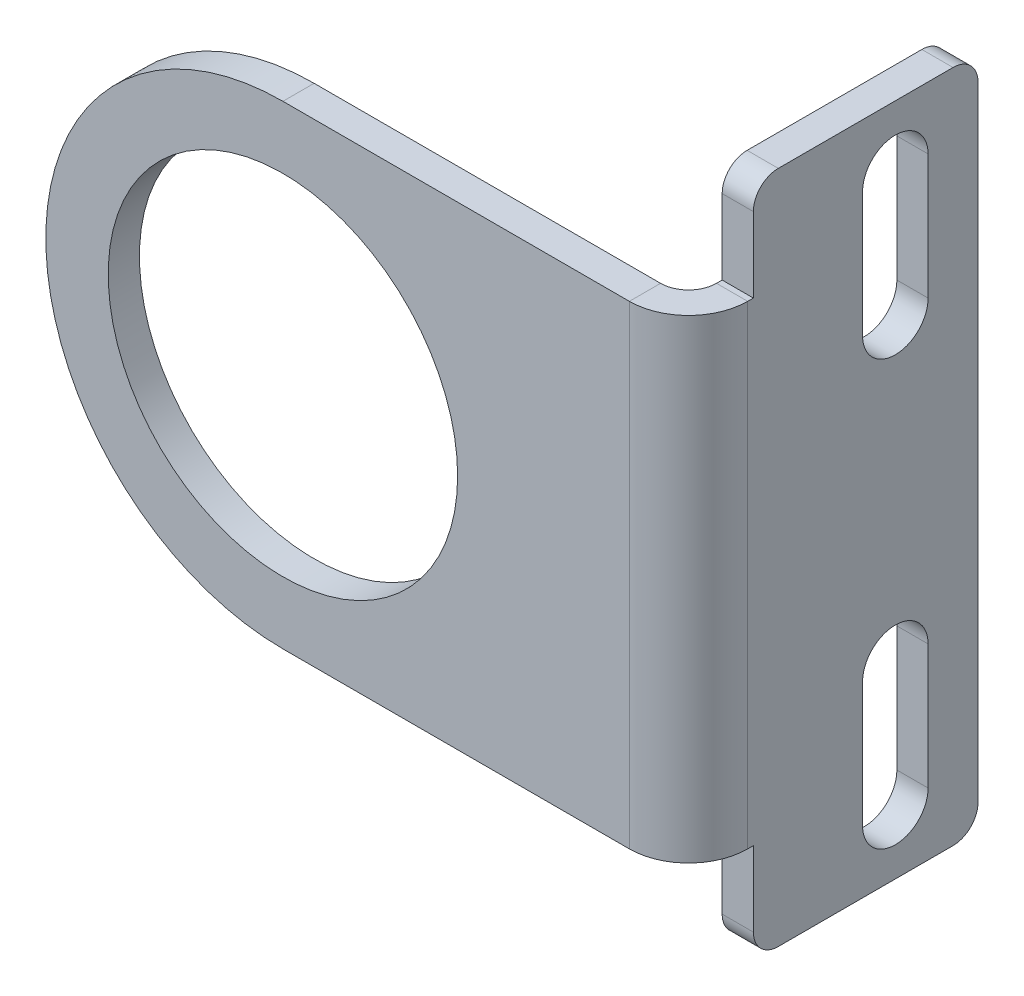
ISO-10303-21;
HEADER;
FILE_DESCRIPTION(('STEP AP214'),'2;1');
FILE_NAME('part.step','',(''),(''),'','','');
FILE_SCHEMA(('AUTOMOTIVE_DESIGN { 1 0 10303 214 1 1 1 1 }'));
ENDSEC;
DATA;
#1=APPLICATION_CONTEXT('core data for automotive mechanical design processes');
#2=APPLICATION_PROTOCOL_DEFINITION('international standard','automotive_design',2000,#1);
#3=PRODUCT_CONTEXT('',#1,'mechanical');
#4=PRODUCT('Part','Part','',(#3));
#5=PRODUCT_RELATED_PRODUCT_CATEGORY('part','',(#4));
#6=PRODUCT_DEFINITION_FORMATION('','',#4);
#7=PRODUCT_DEFINITION_CONTEXT('part definition',#1,'design');
#8=PRODUCT_DEFINITION('design','',#6,#7);
#9=PRODUCT_DEFINITION_SHAPE('','',#8);
#10=(LENGTH_UNIT() NAMED_UNIT(*) SI_UNIT(.MILLI.,.METRE.));
#11=(NAMED_UNIT(*) PLANE_ANGLE_UNIT() SI_UNIT($,.RADIAN.));
#12=(NAMED_UNIT(*) SI_UNIT($,.STERADIAN.) SOLID_ANGLE_UNIT());
#13=UNCERTAINTY_MEASURE_WITH_UNIT(LENGTH_MEASURE(1.E-05),#10,'distance_accuracy_value','');
#14=(GEOMETRIC_REPRESENTATION_CONTEXT(3) GLOBAL_UNCERTAINTY_ASSIGNED_CONTEXT((#13)) GLOBAL_UNIT_ASSIGNED_CONTEXT((#10,
#11,#12)) REPRESENTATION_CONTEXT('',''));
#15=CARTESIAN_POINT('',(0.,0.,0.));
#16=DIRECTION('',(0.,0.,1.));
#17=DIRECTION('',(1.,0.,0.));
#18=AXIS2_PLACEMENT_3D('',#15,#16,#17);
#19=CARTESIAN_POINT('',(30.0000000000001,0.,28.3057296396648));
#20=DIRECTION('',(1.,0.,0.));
#21=DIRECTION('',(0.,0.,-1.));
#22=AXIS2_PLACEMENT_3D('',#19,#20,#21);
#23=PLANE('',#22);
#24=DIRECTION('',(0.,-1.,0.));
#25=VECTOR('',#24,1.);
#26=CARTESIAN_POINT('',(30.,-22.,-13.9442703603352));
#27=LINE('',#26,#25);
#28=CARTESIAN_POINT('',(30.,-12.,-13.9442703603352));
#29=VERTEX_POINT('',#28);
#30=CARTESIAN_POINT('',(30.,-22.,-13.9442703603352));
#31=VERTEX_POINT('',#30);
#32=EDGE_CURVE('E415',#29,#31,#27,.T.);
#33=ORIENTED_EDGE('',*,*,#32,.T.);
#34=CARTESIAN_POINT('',(30.,-22.,-16.5692703603352));
#35=DIRECTION('',(1.,0.,0.));
#36=DIRECTION('',(0.,0.,-1.));
#37=AXIS2_PLACEMENT_3D('',#34,#35,#36);
#38=CIRCLE('',#37,2.62500000000001);
#39=CARTESIAN_POINT('',(30.,-22.,-19.1942703603352));
#40=VERTEX_POINT('',#39);
#41=EDGE_CURVE('E405',#31,#40,#38,.T.);
#42=ORIENTED_EDGE('',*,*,#41,.T.);
#43=DIRECTION('',(0.,1.,0.));
#44=VECTOR('',#43,1.);
#45=CARTESIAN_POINT('',(30.,-22.,-19.1942703603352));
#46=LINE('',#45,#44);
#47=CARTESIAN_POINT('',(30.,-12.,-19.1942703603352));
#48=VERTEX_POINT('',#47);
#49=EDGE_CURVE('E408',#40,#48,#46,.T.);
#50=ORIENTED_EDGE('',*,*,#49,.T.);
#51=CARTESIAN_POINT('',(30.,-12.,-16.5692703603352));
#52=DIRECTION('',(1.,0.,0.));
#53=DIRECTION('',(0.,0.,-1.));
#54=AXIS2_PLACEMENT_3D('',#51,#52,#53);
#55=CIRCLE('',#54,2.62500000000001);
#56=EDGE_CURVE('E412',#48,#29,#55,.T.);
#57=ORIENTED_EDGE('',*,*,#56,.T.);
#58=EDGE_LOOP('',(#33,#42,#50,#57));
#59=FACE_BOUND('',#58,.T.);
#60=DIRECTION('',(0.,-1.,0.));
#61=VECTOR('',#60,1.);
#62=CARTESIAN_POINT('',(30.,12.,-13.9442703603352));
#63=LINE('',#62,#61);
#64=CARTESIAN_POINT('',(30.,22.,-13.9442703603352));
#65=VERTEX_POINT('',#64);
#66=CARTESIAN_POINT('',(30.,12.,-13.9442703603352));
#67=VERTEX_POINT('',#66);
#68=EDGE_CURVE('E383',#65,#67,#63,.T.);
#69=ORIENTED_EDGE('',*,*,#68,.T.);
#70=CARTESIAN_POINT('',(30.,12.,-16.5692703603352));
#71=DIRECTION('',(1.,0.,0.));
#72=DIRECTION('',(0.,0.,-1.));
#73=AXIS2_PLACEMENT_3D('',#70,#71,#72);
#74=CIRCLE('',#73,2.62500000000001);
#75=CARTESIAN_POINT('',(30.,12.,-19.1942703603352));
#76=VERTEX_POINT('',#75);
#77=EDGE_CURVE('E373',#67,#76,#74,.T.);
#78=ORIENTED_EDGE('',*,*,#77,.T.);
#79=DIRECTION('',(0.,1.,0.));
#80=VECTOR('',#79,1.);
#81=CARTESIAN_POINT('',(30.,12.,-19.1942703603352));
#82=LINE('',#81,#80);
#83=CARTESIAN_POINT('',(30.,22.,-19.1942703603352));
#84=VERTEX_POINT('',#83);
#85=EDGE_CURVE('E376',#76,#84,#82,.T.);
#86=ORIENTED_EDGE('',*,*,#85,.T.);
#87=CARTESIAN_POINT('',(30.,22.,-16.5692703603352));
#88=DIRECTION('',(1.,0.,0.));
#89=DIRECTION('',(0.,0.,-1.));
#90=AXIS2_PLACEMENT_3D('',#87,#88,#89);
#91=CIRCLE('',#90,2.62500000000001);
#92=EDGE_CURVE('E380',#84,#65,#91,.T.);
#93=ORIENTED_EDGE('',*,*,#92,.T.);
#94=EDGE_LOOP('',(#69,#78,#86,#93));
#95=FACE_BOUND('',#94,.T.);
#96=DIRECTION('',(0.,-1.,0.));
#97=VECTOR('',#96,1.);
#98=CARTESIAN_POINT('',(30.,27.,-5.19427036033517));
#99=LINE('',#98,#97);
#100=CARTESIAN_POINT('',(30.,25.,-5.19427036033517));
#101=VERTEX_POINT('',#100);
#102=CARTESIAN_POINT('',(30.,19.,-5.19427036033517));
#103=VERTEX_POINT('',#102);
#104=EDGE_CURVE('E257',#101,#103,#99,.T.);
#105=ORIENTED_EDGE('',*,*,#104,.F.);
#106=CARTESIAN_POINT('',(30.,25.,-7.19427036033517));
#107=DIRECTION('',(1.,0.,0.));
#108=DIRECTION('',(0.,0.,-1.));
#109=AXIS2_PLACEMENT_3D('',#106,#107,#108);
#110=CIRCLE('',#109,2.);
#111=CARTESIAN_POINT('',(30.,27.,-7.19427036033517));
#112=VERTEX_POINT('',#111);
#113=EDGE_CURVE('E282',#101,#112,#110,.F.);
#114=ORIENTED_EDGE('',*,*,#113,.T.);
#115=DIRECTION('',(0.,0.,1.));
#116=VECTOR('',#115,1.);
#117=CARTESIAN_POINT('',(30.,27.,-23.1942703603352));
#118=LINE('',#117,#116);
#119=CARTESIAN_POINT('',(30.,27.,-21.1942703603352));
#120=VERTEX_POINT('',#119);
#121=EDGE_CURVE('E440',#120,#112,#118,.T.);
#122=ORIENTED_EDGE('',*,*,#121,.F.);
#123=CARTESIAN_POINT('',(30.,25.,-21.1942703603352));
#124=DIRECTION('',(1.,0.,0.));
#125=DIRECTION('',(0.,0.,-1.));
#126=AXIS2_PLACEMENT_3D('',#123,#124,#125);
#127=CIRCLE('',#126,2.);
#128=CARTESIAN_POINT('',(29.9999999999999,25.,-23.1942703603352));
#129=VERTEX_POINT('',#128);
#130=EDGE_CURVE('E280',#120,#129,#127,.F.);
#131=ORIENTED_EDGE('',*,*,#130,.T.);
#132=DIRECTION('',(0.,1.,0.));
#133=VECTOR('',#132,1.);
#134=CARTESIAN_POINT('',(29.9999999999999,-27.,-23.1942703603352));
#135=LINE('',#134,#133);
#136=CARTESIAN_POINT('',(29.9999999999999,-25.,-23.1942703603352));
#137=VERTEX_POINT('',#136);
#138=EDGE_CURVE('E437',#137,#129,#135,.T.);
#139=ORIENTED_EDGE('',*,*,#138,.F.);
#140=CARTESIAN_POINT('',(30.,-25.,-21.1942703603352));
#141=DIRECTION('',(1.,0.,0.));
#142=DIRECTION('',(0.,0.,-1.));
#143=AXIS2_PLACEMENT_3D('',#140,#141,#142);
#144=CIRCLE('',#143,2.);
#145=CARTESIAN_POINT('',(30.,-27.,-21.1942703603352));
#146=VERTEX_POINT('',#145);
#147=EDGE_CURVE('E70',#137,#146,#144,.F.);
#148=ORIENTED_EDGE('',*,*,#147,.T.);
#149=DIRECTION('',(0.,0.,-1.));
#150=VECTOR('',#149,1.);
#151=CARTESIAN_POINT('',(30.,-27.,-5.19427036033517));
#152=LINE('',#151,#150);
#153=CARTESIAN_POINT('',(30.,-27.,-7.19427036033517));
#154=VERTEX_POINT('',#153);
#155=EDGE_CURVE('E298',#154,#146,#152,.T.);
#156=ORIENTED_EDGE('',*,*,#155,.F.);
#157=CARTESIAN_POINT('',(30.,-25.,-7.19427036033517));
#158=DIRECTION('',(1.,0.,0.));
#159=DIRECTION('',(0.,0.,-1.));
#160=AXIS2_PLACEMENT_3D('',#157,#158,#159);
#161=CIRCLE('',#160,2.);
#162=CARTESIAN_POINT('',(30.,-25.,-5.19427036033517));
#163=VERTEX_POINT('',#162);
#164=EDGE_CURVE('E64',#154,#163,#161,.F.);
#165=ORIENTED_EDGE('',*,*,#164,.T.);
#166=DIRECTION('',(0.,-1.,0.));
#167=VECTOR('',#166,1.);
#168=CARTESIAN_POINT('',(30.,-19.,-5.19427036033517));
#169=LINE('',#168,#167);
#170=CARTESIAN_POINT('',(30.,-19.,-5.19427036033517));
#171=VERTEX_POINT('',#170);
#172=EDGE_CURVE('E236',#171,#163,#169,.T.);
#173=ORIENTED_EDGE('',*,*,#172,.F.);
#174=DIRECTION('',(0.,0.,-1.));
#175=VECTOR('',#174,1.);
#176=CARTESIAN_POINT('',(30.0000000000001,-19.,28.3057296396648));
#177=LINE('',#176,#175);
#178=CARTESIAN_POINT('',(30.,-19.,-4.74000000000001));
#179=VERTEX_POINT('',#178);
#180=EDGE_CURVE('E234',#179,#171,#177,.T.);
#181=ORIENTED_EDGE('',*,*,#180,.F.);
#182=DIRECTION('',(0.,1.,0.));
#183=VECTOR('',#182,1.);
#184=CARTESIAN_POINT('',(30.,0.,-4.74000000000001));
#185=LINE('',#184,#183);
#186=CARTESIAN_POINT('',(30.,19.,-4.74000000000001));
#187=VERTEX_POINT('',#186);
#188=EDGE_CURVE('E212',#179,#187,#185,.T.);
#189=ORIENTED_EDGE('',*,*,#188,.T.);
#190=DIRECTION('',(0.,0.,1.));
#191=VECTOR('',#190,1.);
#192=CARTESIAN_POINT('',(30.,19.,-5.19427036033517));
#193=LINE('',#192,#191);
#194=EDGE_CURVE('E254',#103,#187,#193,.T.);
#195=ORIENTED_EDGE('',*,*,#194,.F.);
#196=EDGE_LOOP('',(#105,#114,#122,#131,#139,#148,#156,#165,#173,#181,#189,#195));
#197=FACE_BOUND('',#196,.T.);
#198=ADVANCED_FACE('F49',(#59,#95,#197),#23,.F.);
#199=CARTESIAN_POINT('',(30.,19.,-5.19427036033517));
#200=DIRECTION('',(0.,1.,0.));
#201=DIRECTION('',(0.,0.,1.));
#202=AXIS2_PLACEMENT_3D('',#199,#200,#201);
#203=PLANE('',#202);
#204=DIRECTION('',(-1.,0.,0.));
#205=VECTOR('',#204,1.);
#206=CARTESIAN_POINT('',(30.,19.,-4.74000000000001));
#207=LINE('',#206,#205);
#208=CARTESIAN_POINT('',(32.5,19.,-4.74000000000002));
#209=VERTEX_POINT('',#208);
#210=EDGE_CURVE('E248',#209,#187,#207,.T.);
#211=ORIENTED_EDGE('',*,*,#210,.F.);
#212=DIRECTION('',(0.,0.,1.));
#213=VECTOR('',#212,1.);
#214=CARTESIAN_POINT('',(32.5,19.,-5.19427036033518));
#215=LINE('',#214,#213);
#216=CARTESIAN_POINT('',(32.5,19.,-5.19427036033518));
#217=VERTEX_POINT('',#216);
#218=EDGE_CURVE('E240',#217,#209,#215,.T.);
#219=ORIENTED_EDGE('',*,*,#218,.F.);
#220=DIRECTION('',(1.,0.,0.));
#221=VECTOR('',#220,1.);
#222=CARTESIAN_POINT('',(30.,19.,-5.19427036033517));
#223=LINE('',#222,#221);
#224=EDGE_CURVE('E224',#103,#217,#223,.T.);
#225=ORIENTED_EDGE('',*,*,#224,.F.);
#226=ORIENTED_EDGE('',*,*,#194,.T.);
#227=EDGE_LOOP('',(#211,#219,#225,#226));
#228=FACE_BOUND('',#227,.T.);
#229=ADVANCED_FACE('F449',(#228),#203,.T.);
#230=CARTESIAN_POINT('',(30.,27.,-5.19427036033517));
#231=DIRECTION('',(0.,0.,1.));
#232=DIRECTION('',(1.,0.,0.));
#233=AXIS2_PLACEMENT_3D('',#230,#231,#232);
#234=PLANE('',#233);
#235=DIRECTION('',(0.,-1.,0.));
#236=VECTOR('',#235,1.);
#237=CARTESIAN_POINT('',(32.5,27.,-5.19427036033518));
#238=LINE('',#237,#236);
#239=CARTESIAN_POINT('',(32.5,25.,-5.19427036033518));
#240=VERTEX_POINT('',#239);
#241=EDGE_CURVE('E260',#240,#217,#238,.T.);
#242=ORIENTED_EDGE('',*,*,#241,.F.);
#243=DIRECTION('',(1.,0.,0.));
#244=VECTOR('',#243,1.);
#245=CARTESIAN_POINT('',(30.,25.,-5.19427036033517));
#246=LINE('',#245,#244);
#247=EDGE_CURVE('E276',#240,#101,#246,.F.);
#248=ORIENTED_EDGE('',*,*,#247,.T.);
#249=ORIENTED_EDGE('',*,*,#104,.T.);
#250=ORIENTED_EDGE('',*,*,#224,.T.);
#251=EDGE_LOOP('',(#242,#248,#249,#250));
#252=FACE_BOUND('',#251,.T.);
#253=ADVANCED_FACE('F445',(#252),#234,.T.);
#254=CARTESIAN_POINT('',(30.,27.,-23.1942703603352));
#255=DIRECTION('',(0.,1.,0.));
#256=DIRECTION('',(1.,0.,0.));
#257=AXIS2_PLACEMENT_3D('',#254,#255,#256);
#258=PLANE('',#257);
#259=ORIENTED_EDGE('',*,*,#121,.T.);
#260=DIRECTION('',(1.,0.,0.));
#261=VECTOR('',#260,1.);
#262=CARTESIAN_POINT('',(30.,27.,-7.19427036033517));
#263=LINE('',#262,#261);
#264=CARTESIAN_POINT('',(32.5,27.,-7.19427036033518));
#265=VERTEX_POINT('',#264);
#266=EDGE_CURVE('E265',#112,#265,#263,.T.);
#267=ORIENTED_EDGE('',*,*,#266,.T.);
#268=DIRECTION('',(0.,0.,1.));
#269=VECTOR('',#268,1.);
#270=CARTESIAN_POINT('',(32.4999999999999,27.,-23.1942703603352));
#271=LINE('',#270,#269);
#272=CARTESIAN_POINT('',(32.5,27.,-21.1942703603352));
#273=VERTEX_POINT('',#272);
#274=EDGE_CURVE('E309',#273,#265,#271,.T.);
#275=ORIENTED_EDGE('',*,*,#274,.F.);
#276=DIRECTION('',(1.,0.,0.));
#277=VECTOR('',#276,1.);
#278=CARTESIAN_POINT('',(30.,27.,-21.1942703603352));
#279=LINE('',#278,#277);
#280=EDGE_CURVE('E253',#273,#120,#279,.F.);
#281=ORIENTED_EDGE('',*,*,#280,.T.);
#282=EDGE_LOOP('',(#259,#267,#275,#281));
#283=FACE_BOUND('',#282,.T.);
#284=ADVANCED_FACE('F456',(#283),#258,.T.);
#285=CARTESIAN_POINT('',(29.9999999999999,-27.,-23.1942703603352));
#286=DIRECTION('',(0.,0.,-1.));
#287=DIRECTION('',(-1.,0.,0.));
#288=AXIS2_PLACEMENT_3D('',#285,#286,#287);
#289=PLANE('',#288);
#290=ORIENTED_EDGE('',*,*,#138,.T.);
#291=DIRECTION('',(1.,0.,0.));
#292=VECTOR('',#291,1.);
#293=CARTESIAN_POINT('',(29.9999999999999,25.,-23.1942703603352));
#294=LINE('',#293,#292);
#295=CARTESIAN_POINT('',(32.5,25.,-23.1942703603352));
#296=VERTEX_POINT('',#295);
#297=EDGE_CURVE('E286',#129,#296,#294,.T.);
#298=ORIENTED_EDGE('',*,*,#297,.T.);
#299=DIRECTION('',(0.,1.,0.));
#300=VECTOR('',#299,1.);
#301=CARTESIAN_POINT('',(32.4999999999999,-27.,-23.1942703603352));
#302=LINE('',#301,#300);
#303=CARTESIAN_POINT('',(32.4999999999999,-25.,-23.1942703603352));
#304=VERTEX_POINT('',#303);
#305=EDGE_CURVE('E307',#304,#296,#302,.T.);
#306=ORIENTED_EDGE('',*,*,#305,.F.);
#307=DIRECTION('',(1.,0.,0.));
#308=VECTOR('',#307,1.);
#309=CARTESIAN_POINT('',(29.9999999999999,-25.,-23.1942703603352));
#310=LINE('',#309,#308);
#311=EDGE_CURVE('E284',#304,#137,#310,.F.);
#312=ORIENTED_EDGE('',*,*,#311,.T.);
#313=EDGE_LOOP('',(#290,#298,#306,#312));
#314=FACE_BOUND('',#313,.T.);
#315=ADVANCED_FACE('F479',(#314),#289,.T.);
#316=CARTESIAN_POINT('',(30.,-27.,-5.19427036033517));
#317=DIRECTION('',(0.,-1.,0.));
#318=DIRECTION('',(-1.,0.,0.));
#319=AXIS2_PLACEMENT_3D('',#316,#317,#318);
#320=PLANE('',#319);
#321=ORIENTED_EDGE('',*,*,#155,.T.);
#322=DIRECTION('',(1.,0.,0.));
#323=VECTOR('',#322,1.);
#324=CARTESIAN_POINT('',(30.,-27.,-21.1942703603352));
#325=LINE('',#324,#323);
#326=CARTESIAN_POINT('',(32.5,-27.,-21.1942703603352));
#327=VERTEX_POINT('',#326);
#328=EDGE_CURVE('E57',#146,#327,#325,.T.);
#329=ORIENTED_EDGE('',*,*,#328,.T.);
#330=DIRECTION('',(0.,0.,-1.));
#331=VECTOR('',#330,1.);
#332=CARTESIAN_POINT('',(32.5,-27.,-5.19427036033518));
#333=LINE('',#332,#331);
#334=CARTESIAN_POINT('',(32.5,-27.,-7.19427036033518));
#335=VERTEX_POINT('',#334);
#336=EDGE_CURVE('E296',#335,#327,#333,.T.);
#337=ORIENTED_EDGE('',*,*,#336,.F.);
#338=DIRECTION('',(1.,0.,0.));
#339=VECTOR('',#338,1.);
#340=CARTESIAN_POINT('',(30.,-27.,-7.19427036033517));
#341=LINE('',#340,#339);
#342=EDGE_CURVE('E289',#335,#154,#341,.F.);
#343=ORIENTED_EDGE('',*,*,#342,.T.);
#344=EDGE_LOOP('',(#321,#329,#337,#343));
#345=FACE_BOUND('',#344,.T.);
#346=ADVANCED_FACE('F295',(#345),#320,.T.);
#347=CARTESIAN_POINT('',(30.,-19.,-5.19427036033517));
#348=DIRECTION('',(0.,0.,1.));
#349=DIRECTION('',(1.,0.,0.));
#350=AXIS2_PLACEMENT_3D('',#347,#348,#349);
#351=PLANE('',#350);
#352=ORIENTED_EDGE('',*,*,#172,.T.);
#353=DIRECTION('',(1.,0.,0.));
#354=VECTOR('',#353,1.);
#355=CARTESIAN_POINT('',(30.,-25.,-5.19427036033517));
#356=LINE('',#355,#354);
#357=CARTESIAN_POINT('',(32.5,-25.,-5.19427036033518));
#358=VERTEX_POINT('',#357);
#359=EDGE_CURVE('E12',#163,#358,#356,.T.);
#360=ORIENTED_EDGE('',*,*,#359,.T.);
#361=DIRECTION('',(0.,-1.,0.));
#362=VECTOR('',#361,1.);
#363=CARTESIAN_POINT('',(32.5,-19.,-5.19427036033518));
#364=LINE('',#363,#362);
#365=CARTESIAN_POINT('',(32.5,-19.,-5.19427036033518));
#366=VERTEX_POINT('',#365);
#367=EDGE_CURVE('E261',#366,#358,#364,.T.);
#368=ORIENTED_EDGE('',*,*,#367,.F.);
#369=DIRECTION('',(1.,0.,0.));
#370=VECTOR('',#369,1.);
#371=CARTESIAN_POINT('',(30.,-19.,-5.19427036033517));
#372=LINE('',#371,#370);
#373=EDGE_CURVE('E256',#171,#366,#372,.T.);
#374=ORIENTED_EDGE('',*,*,#373,.F.);
#375=EDGE_LOOP('',(#352,#360,#368,#374));
#376=FACE_BOUND('',#375,.T.);
#377=ADVANCED_FACE('F319',(#376),#351,.T.);
#378=CARTESIAN_POINT('',(30.0000000000001,-19.,28.3057296396648));
#379=DIRECTION('',(0.,-1.,0.));
#380=DIRECTION('',(0.,0.,-1.));
#381=AXIS2_PLACEMENT_3D('',#378,#379,#380);
#382=PLANE('',#381);
#383=DIRECTION('',(1.,0.,0.));
#384=VECTOR('',#383,1.);
#385=CARTESIAN_POINT('',(30.,-19.,-4.74000000000001));
#386=LINE('',#385,#384);
#387=CARTESIAN_POINT('',(32.5,-19.,-4.74000000000002));
#388=VERTEX_POINT('',#387);
#389=EDGE_CURVE('E223',#179,#388,#386,.T.);
#390=ORIENTED_EDGE('',*,*,#389,.F.);
#391=ORIENTED_EDGE('',*,*,#180,.T.);
#392=ORIENTED_EDGE('',*,*,#373,.T.);
#393=DIRECTION('',(0.,0.,-1.));
#394=VECTOR('',#393,1.);
#395=CARTESIAN_POINT('',(32.5000000000001,-19.,28.3057296396648));
#396=LINE('',#395,#394);
#397=EDGE_CURVE('E244',#388,#366,#396,.T.);
#398=ORIENTED_EDGE('',*,*,#397,.F.);
#399=EDGE_LOOP('',(#390,#391,#392,#398));
#400=FACE_BOUND('',#399,.T.);
#401=ADVANCED_FACE('F243',(#400),#382,.T.);
#402=CARTESIAN_POINT('',(32.5000000000001,0.,28.3057296396648));
#403=DIRECTION('',(1.,0.,0.));
#404=DIRECTION('',(0.,0.,-1.));
#405=AXIS2_PLACEMENT_3D('',#402,#403,#404);
#406=PLANE('',#405);
#407=ORIENTED_EDGE('',*,*,#274,.T.);
#408=CARTESIAN_POINT('',(32.5,25.,-7.19427036033518));
#409=DIRECTION('',(1.,0.,0.));
#410=DIRECTION('',(0.,0.,-1.));
#411=AXIS2_PLACEMENT_3D('',#408,#409,#410);
#412=CIRCLE('',#411,2.);
#413=EDGE_CURVE('E274',#265,#240,#412,.T.);
#414=ORIENTED_EDGE('',*,*,#413,.T.);
#415=ORIENTED_EDGE('',*,*,#241,.T.);
#416=ORIENTED_EDGE('',*,*,#218,.T.);
#417=DIRECTION('',(0.,1.,0.));
#418=VECTOR('',#417,1.);
#419=CARTESIAN_POINT('',(32.5,0.,-4.74000000000002));
#420=LINE('',#419,#418);
#421=EDGE_CURVE('E246',#388,#209,#420,.T.);
#422=ORIENTED_EDGE('',*,*,#421,.F.);
#423=ORIENTED_EDGE('',*,*,#397,.T.);
#424=ORIENTED_EDGE('',*,*,#367,.T.);
#425=CARTESIAN_POINT('',(32.5,-25.,-7.19427036033518));
#426=DIRECTION('',(1.,0.,0.));
#427=DIRECTION('',(0.,0.,-1.));
#428=AXIS2_PLACEMENT_3D('',#425,#426,#427);
#429=CIRCLE('',#428,2.);
#430=EDGE_CURVE('E268',#358,#335,#429,.T.);
#431=ORIENTED_EDGE('',*,*,#430,.T.);
#432=ORIENTED_EDGE('',*,*,#336,.T.);
#433=CARTESIAN_POINT('',(32.5,-25.,-21.1942703603352));
#434=DIRECTION('',(1.,0.,0.));
#435=DIRECTION('',(0.,0.,-1.));
#436=AXIS2_PLACEMENT_3D('',#433,#434,#435);
#437=CIRCLE('',#436,2.);
#438=EDGE_CURVE('E270',#327,#304,#437,.T.);
#439=ORIENTED_EDGE('',*,*,#438,.T.);
#440=ORIENTED_EDGE('',*,*,#305,.T.);
#441=CARTESIAN_POINT('',(32.5,25.,-21.1942703603352));
#442=DIRECTION('',(1.,0.,0.));
#443=DIRECTION('',(0.,0.,-1.));
#444=AXIS2_PLACEMENT_3D('',#441,#442,#443);
#445=CIRCLE('',#444,2.);
#446=EDGE_CURVE('E272',#296,#273,#445,.T.);
#447=ORIENTED_EDGE('',*,*,#446,.T.);
#448=EDGE_LOOP('',(#407,#414,#415,#416,#422,#423,#424,#431,#432,#439,#440,#447));
#449=FACE_BOUND('',#448,.T.);
#450=CARTESIAN_POINT('',(32.5,12.,-16.5692703603352));
#451=DIRECTION('',(1.,0.,0.));
#452=DIRECTION('',(0.,0.,-1.));
#453=AXIS2_PLACEMENT_3D('',#450,#451,#452);
#454=CIRCLE('',#453,2.62500000000001);
#455=CARTESIAN_POINT('',(32.5,12.,-13.9442703603352));
#456=VERTEX_POINT('',#455);
#457=CARTESIAN_POINT('',(32.5,12.,-19.1942703603352));
#458=VERTEX_POINT('',#457);
#459=EDGE_CURVE('E341',#456,#458,#454,.T.);
#460=ORIENTED_EDGE('',*,*,#459,.F.);
#461=DIRECTION('',(0.,-1.,0.));
#462=VECTOR('',#461,1.);
#463=CARTESIAN_POINT('',(32.5,12.,-13.9442703603352));
#464=LINE('',#463,#462);
#465=CARTESIAN_POINT('',(32.5,22.,-13.9442703603352));
#466=VERTEX_POINT('',#465);
#467=EDGE_CURVE('E377',#466,#456,#464,.T.);
#468=ORIENTED_EDGE('',*,*,#467,.F.);
#469=CARTESIAN_POINT('',(32.5,22.,-16.5692703603352));
#470=DIRECTION('',(1.,0.,0.));
#471=DIRECTION('',(0.,0.,-1.));
#472=AXIS2_PLACEMENT_3D('',#469,#470,#471);
#473=CIRCLE('',#472,2.62500000000001);
#474=CARTESIAN_POINT('',(32.5,22.,-19.1942703603352));
#475=VERTEX_POINT('',#474);
#476=EDGE_CURVE('E391',#475,#466,#473,.T.);
#477=ORIENTED_EDGE('',*,*,#476,.F.);
#478=DIRECTION('',(0.,1.,0.));
#479=VECTOR('',#478,1.);
#480=CARTESIAN_POINT('',(32.5,12.,-19.1942703603352));
#481=LINE('',#480,#479);
#482=EDGE_CURVE('E388',#458,#475,#481,.T.);
#483=ORIENTED_EDGE('',*,*,#482,.F.);
#484=EDGE_LOOP('',(#460,#468,#477,#483));
#485=FACE_BOUND('',#484,.T.);
#486=CARTESIAN_POINT('',(32.5,-22.,-16.5692703603352));
#487=DIRECTION('',(1.,0.,0.));
#488=DIRECTION('',(0.,0.,-1.));
#489=AXIS2_PLACEMENT_3D('',#486,#487,#488);
#490=CIRCLE('',#489,2.62500000000001);
#491=CARTESIAN_POINT('',(32.5,-22.,-13.9442703603352));
#492=VERTEX_POINT('',#491);
#493=CARTESIAN_POINT('',(32.5,-22.,-19.1942703603352));
#494=VERTEX_POINT('',#493);
#495=EDGE_CURVE('E398',#492,#494,#490,.T.);
#496=ORIENTED_EDGE('',*,*,#495,.F.);
#497=DIRECTION('',(0.,-1.,0.));
#498=VECTOR('',#497,1.);
#499=CARTESIAN_POINT('',(32.5,-22.,-13.9442703603352));
#500=LINE('',#499,#498);
#501=CARTESIAN_POINT('',(32.5,-12.,-13.9442703603352));
#502=VERTEX_POINT('',#501);
#503=EDGE_CURVE('E409',#502,#492,#500,.T.);
#504=ORIENTED_EDGE('',*,*,#503,.F.);
#505=CARTESIAN_POINT('',(32.5,-12.,-16.5692703603352));
#506=DIRECTION('',(1.,0.,0.));
#507=DIRECTION('',(0.,0.,-1.));
#508=AXIS2_PLACEMENT_3D('',#505,#506,#507);
#509=CIRCLE('',#508,2.62500000000001);
#510=CARTESIAN_POINT('',(32.5,-12.,-19.1942703603352));
#511=VERTEX_POINT('',#510);
#512=EDGE_CURVE('E423',#511,#502,#509,.T.);
#513=ORIENTED_EDGE('',*,*,#512,.F.);
#514=DIRECTION('',(0.,1.,0.));
#515=VECTOR('',#514,1.);
#516=CARTESIAN_POINT('',(32.5,-22.,-19.1942703603352));
#517=LINE('',#516,#515);
#518=EDGE_CURVE('E420',#494,#511,#517,.T.);
#519=ORIENTED_EDGE('',*,*,#518,.F.);
#520=EDGE_LOOP('',(#496,#504,#513,#519));
#521=FACE_BOUND('',#520,.T.);
#522=ADVANCED_FACE('F302',(#449,#485,#521),#406,.T.);
#523=CARTESIAN_POINT('',(30.,-22.,-16.5692703603352));
#524=DIRECTION('',(1.,0.,0.));
#525=DIRECTION('',(0.,0.,-1.));
#526=AXIS2_PLACEMENT_3D('',#523,#524,#525);
#527=CYLINDRICAL_SURFACE('',#526,2.62500000000001);
#528=ORIENTED_EDGE('',*,*,#495,.T.);
#529=DIRECTION('',(1.,0.,0.));
#530=VECTOR('',#529,1.);
#531=CARTESIAN_POINT('',(30.,-22.,-19.1942703603352));
#532=LINE('',#531,#530);
#533=EDGE_CURVE('E418',#40,#494,#532,.T.);
#534=ORIENTED_EDGE('',*,*,#533,.F.);
#535=ORIENTED_EDGE('',*,*,#41,.F.);
#536=DIRECTION('',(1.,0.,0.));
#537=VECTOR('',#536,1.);
#538=CARTESIAN_POINT('',(30.,-22.,-13.9442703603352));
#539=LINE('',#538,#537);
#540=EDGE_CURVE('E262',#31,#492,#539,.T.);
#541=ORIENTED_EDGE('',*,*,#540,.T.);
#542=EDGE_LOOP('',(#528,#534,#535,#541));
#543=FACE_BOUND('',#542,.T.);
#544=ADVANCED_FACE('F502',(#543),#527,.F.);
#545=CARTESIAN_POINT('',(30.,-22.,-13.9442703603352));
#546=DIRECTION('',(0.,0.,1.));
#547=DIRECTION('',(1.,0.,0.));
#548=AXIS2_PLACEMENT_3D('',#545,#546,#547);
#549=PLANE('',#548);
#550=ORIENTED_EDGE('',*,*,#503,.T.);
#551=ORIENTED_EDGE('',*,*,#540,.F.);
#552=ORIENTED_EDGE('',*,*,#32,.F.);
#553=DIRECTION('',(1.,0.,0.));
#554=VECTOR('',#553,1.);
#555=CARTESIAN_POINT('',(30.,-12.,-13.9442703603352));
#556=LINE('',#555,#554);
#557=EDGE_CURVE('E429',#29,#502,#556,.T.);
#558=ORIENTED_EDGE('',*,*,#557,.T.);
#559=EDGE_LOOP('',(#550,#551,#552,#558));
#560=FACE_BOUND('',#559,.T.);
#561=ADVANCED_FACE('F505',(#560),#549,.F.);
#562=CARTESIAN_POINT('',(30.,-12.,-16.5692703603352));
#563=DIRECTION('',(1.,0.,0.));
#564=DIRECTION('',(0.,0.,-1.));
#565=AXIS2_PLACEMENT_3D('',#562,#563,#564);
#566=CYLINDRICAL_SURFACE('',#565,2.62500000000001);
#567=ORIENTED_EDGE('',*,*,#512,.T.);
#568=ORIENTED_EDGE('',*,*,#557,.F.);
#569=ORIENTED_EDGE('',*,*,#56,.F.);
#570=DIRECTION('',(1.,0.,0.));
#571=VECTOR('',#570,1.);
#572=CARTESIAN_POINT('',(30.,-12.,-19.1942703603352));
#573=LINE('',#572,#571);
#574=EDGE_CURVE('E431',#48,#511,#573,.T.);
#575=ORIENTED_EDGE('',*,*,#574,.T.);
#576=EDGE_LOOP('',(#567,#568,#569,#575));
#577=FACE_BOUND('',#576,.T.);
#578=ADVANCED_FACE('F510',(#577),#566,.F.);
#579=CARTESIAN_POINT('',(30.,-22.,-19.1942703603352));
#580=DIRECTION('',(0.,0.,-1.));
#581=DIRECTION('',(-1.,0.,0.));
#582=AXIS2_PLACEMENT_3D('',#579,#580,#581);
#583=PLANE('',#582);
#584=ORIENTED_EDGE('',*,*,#518,.T.);
#585=ORIENTED_EDGE('',*,*,#574,.F.);
#586=ORIENTED_EDGE('',*,*,#49,.F.);
#587=ORIENTED_EDGE('',*,*,#533,.T.);
#588=EDGE_LOOP('',(#584,#585,#586,#587));
#589=FACE_BOUND('',#588,.T.);
#590=ADVANCED_FACE('F514',(#589),#583,.F.);
#591=CARTESIAN_POINT('',(30.,12.,-16.5692703603352));
#592=DIRECTION('',(1.,0.,0.));
#593=DIRECTION('',(0.,0.,-1.));
#594=AXIS2_PLACEMENT_3D('',#591,#592,#593);
#595=CYLINDRICAL_SURFACE('',#594,2.62500000000001);
#596=ORIENTED_EDGE('',*,*,#459,.T.);
#597=DIRECTION('',(1.,0.,0.));
#598=VECTOR('',#597,1.);
#599=CARTESIAN_POINT('',(30.,12.,-19.1942703603352));
#600=LINE('',#599,#598);
#601=EDGE_CURVE('E386',#76,#458,#600,.T.);
#602=ORIENTED_EDGE('',*,*,#601,.F.);
#603=ORIENTED_EDGE('',*,*,#77,.F.);
#604=DIRECTION('',(1.,0.,0.));
#605=VECTOR('',#604,1.);
#606=CARTESIAN_POINT('',(30.,12.,-13.9442703603352));
#607=LINE('',#606,#605);
#608=EDGE_CURVE('E396',#67,#456,#607,.T.);
#609=ORIENTED_EDGE('',*,*,#608,.T.);
#610=EDGE_LOOP('',(#596,#602,#603,#609));
#611=FACE_BOUND('',#610,.T.);
#612=ADVANCED_FACE('F517',(#611),#595,.F.);
#613=CARTESIAN_POINT('',(30.,12.,-13.9442703603352));
#614=DIRECTION('',(0.,0.,1.));
#615=DIRECTION('',(1.,0.,0.));
#616=AXIS2_PLACEMENT_3D('',#613,#614,#615);
#617=PLANE('',#616);
#618=ORIENTED_EDGE('',*,*,#467,.T.);
#619=ORIENTED_EDGE('',*,*,#608,.F.);
#620=ORIENTED_EDGE('',*,*,#68,.F.);
#621=DIRECTION('',(1.,0.,0.));
#622=VECTOR('',#621,1.);
#623=CARTESIAN_POINT('',(30.,22.,-13.9442703603352));
#624=LINE('',#623,#622);
#625=EDGE_CURVE('E399',#65,#466,#624,.T.);
#626=ORIENTED_EDGE('',*,*,#625,.T.);
#627=EDGE_LOOP('',(#618,#619,#620,#626));
#628=FACE_BOUND('',#627,.T.);
#629=ADVANCED_FACE('F524',(#628),#617,.F.);
#630=CARTESIAN_POINT('',(30.,22.,-16.5692703603352));
#631=DIRECTION('',(1.,0.,0.));
#632=DIRECTION('',(0.,0.,-1.));
#633=AXIS2_PLACEMENT_3D('',#630,#631,#632);
#634=CYLINDRICAL_SURFACE('',#633,2.62500000000001);
#635=ORIENTED_EDGE('',*,*,#476,.T.);
#636=ORIENTED_EDGE('',*,*,#625,.F.);
#637=ORIENTED_EDGE('',*,*,#92,.F.);
#638=DIRECTION('',(1.,0.,0.));
#639=VECTOR('',#638,1.);
#640=CARTESIAN_POINT('',(30.,22.,-19.1942703603352));
#641=LINE('',#640,#639);
#642=EDGE_CURVE('E401',#84,#475,#641,.T.);
#643=ORIENTED_EDGE('',*,*,#642,.T.);
#644=EDGE_LOOP('',(#635,#636,#637,#643));
#645=FACE_BOUND('',#644,.T.);
#646=ADVANCED_FACE('F530',(#645),#634,.F.);
#647=CARTESIAN_POINT('',(30.,12.,-19.1942703603352));
#648=DIRECTION('',(0.,0.,-1.));
#649=DIRECTION('',(-1.,0.,0.));
#650=AXIS2_PLACEMENT_3D('',#647,#648,#649);
#651=PLANE('',#650);
#652=ORIENTED_EDGE('',*,*,#482,.T.);
#653=ORIENTED_EDGE('',*,*,#642,.F.);
#654=ORIENTED_EDGE('',*,*,#85,.F.);
#655=ORIENTED_EDGE('',*,*,#601,.T.);
#656=EDGE_LOOP('',(#652,#653,#654,#655));
#657=FACE_BOUND('',#656,.T.);
#658=ADVANCED_FACE('F526',(#657),#651,.F.);
#659=CARTESIAN_POINT('',(0.,0.,-2.5));
#660=DIRECTION('',(0.,0.,1.));
#661=DIRECTION('',(1.,0.,0.));
#662=AXIS2_PLACEMENT_3D('',#659,#660,#661);
#663=CYLINDRICAL_SURFACE('',#662,14.);
#664=CARTESIAN_POINT('',(0.,0.,-2.5));
#665=DIRECTION('',(0.,0.,1.));
#666=DIRECTION('',(1.,0.,0.));
#667=AXIS2_PLACEMENT_3D('',#664,#665,#666);
#668=CIRCLE('',#667,14.);
#669=CARTESIAN_POINT('',(14.,0.,-2.5));
#670=VERTEX_POINT('',#669);
#671=EDGE_CURVE('E360',#670,#670,#668,.T.);
#672=ORIENTED_EDGE('',*,*,#671,.F.);
#673=EDGE_LOOP('',(#672));
#674=FACE_BOUND('',#673,.T.);
#675=CARTESIAN_POINT('',(0.,0.,0.));
#676=DIRECTION('',(0.,0.,1.));
#677=DIRECTION('',(1.,0.,0.));
#678=AXIS2_PLACEMENT_3D('',#675,#676,#677);
#679=CIRCLE('',#678,14.);
#680=CARTESIAN_POINT('',(14.,0.,0.));
#681=VERTEX_POINT('',#680);
#682=EDGE_CURVE('E368',#681,#681,#679,.T.);
#683=ORIENTED_EDGE('',*,*,#682,.T.);
#684=EDGE_LOOP('',(#683));
#685=FACE_BOUND('',#684,.T.);
#686=ADVANCED_FACE('F529',(#674,#685),#663,.F.);
#687=CARTESIAN_POINT('',(0.,0.,-2.5));
#688=DIRECTION('',(0.,0.,1.));
#689=DIRECTION('',(1.,0.,0.));
#690=AXIS2_PLACEMENT_3D('',#687,#688,#689);
#691=CYLINDRICAL_SURFACE('',#690,19.);
#692=CARTESIAN_POINT('',(0.,0.,0.));
#693=DIRECTION('',(0.,0.,1.));
#694=DIRECTION('',(1.,0.,0.));
#695=AXIS2_PLACEMENT_3D('',#692,#693,#694);
#696=CIRCLE('',#695,19.);
#697=CARTESIAN_POINT('',(0.,19.,0.));
#698=VERTEX_POINT('',#697);
#699=CARTESIAN_POINT('',(0.,-19.,0.));
#700=VERTEX_POINT('',#699);
#701=EDGE_CURVE('E345',#698,#700,#696,.T.);
#702=ORIENTED_EDGE('',*,*,#701,.F.);
#703=DIRECTION('',(0.,0.,1.));
#704=VECTOR('',#703,1.);
#705=CARTESIAN_POINT('',(0.,19.,-2.5));
#706=LINE('',#705,#704);
#707=CARTESIAN_POINT('',(0.,19.,-2.5));
#708=VERTEX_POINT('',#707);
#709=EDGE_CURVE('E338',#708,#698,#706,.T.);
#710=ORIENTED_EDGE('',*,*,#709,.F.);
#711=CARTESIAN_POINT('',(0.,0.,-2.5));
#712=DIRECTION('',(0.,0.,1.));
#713=DIRECTION('',(1.,0.,0.));
#714=AXIS2_PLACEMENT_3D('',#711,#712,#713);
#715=CIRCLE('',#714,19.);
#716=CARTESIAN_POINT('',(0.,-19.,-2.5));
#717=VERTEX_POINT('',#716);
#718=EDGE_CURVE('E365',#708,#717,#715,.T.);
#719=ORIENTED_EDGE('',*,*,#718,.T.);
#720=DIRECTION('',(0.,0.,1.));
#721=VECTOR('',#720,1.);
#722=CARTESIAN_POINT('',(0.,-19.,-2.5));
#723=LINE('',#722,#721);
#724=EDGE_CURVE('E363',#717,#700,#723,.T.);
#725=ORIENTED_EDGE('',*,*,#724,.T.);
#726=EDGE_LOOP('',(#702,#710,#719,#725));
#727=FACE_BOUND('',#726,.T.);
#728=ADVANCED_FACE('F553',(#727),#691,.T.);
#729=CARTESIAN_POINT('',(0.,0.,-2.5));
#730=DIRECTION('',(0.,0.,1.));
#731=DIRECTION('',(1.,0.,0.));
#732=AXIS2_PLACEMENT_3D('',#729,#730,#731);
#733=PLANE('',#732);
#734=DIRECTION('',(0.,1.,0.));
#735=VECTOR('',#734,1.);
#736=CARTESIAN_POINT('',(27.76,0.,-2.5));
#737=LINE('',#736,#735);
#738=CARTESIAN_POINT('',(27.76,-19.,-2.5));
#739=VERTEX_POINT('',#738);
#740=CARTESIAN_POINT('',(27.76,19.,-2.5));
#741=VERTEX_POINT('',#740);
#742=EDGE_CURVE('E371',#739,#741,#737,.T.);
#743=ORIENTED_EDGE('',*,*,#742,.F.);
#744=DIRECTION('',(1.,0.,0.));
#745=VECTOR('',#744,1.);
#746=CARTESIAN_POINT('',(0.,-19.,-2.5));
#747=LINE('',#746,#745);
#748=EDGE_CURVE('E357',#717,#739,#747,.T.);
#749=ORIENTED_EDGE('',*,*,#748,.F.);
#750=ORIENTED_EDGE('',*,*,#718,.F.);
#751=DIRECTION('',(-1.,0.,0.));
#752=VECTOR('',#751,1.);
#753=CARTESIAN_POINT('',(33.5,19.,-2.5));
#754=LINE('',#753,#752);
#755=EDGE_CURVE('E342',#741,#708,#754,.T.);
#756=ORIENTED_EDGE('',*,*,#755,.F.);
#757=EDGE_LOOP('',(#743,#749,#750,#756));
#758=FACE_BOUND('',#757,.T.);
#759=ORIENTED_EDGE('',*,*,#671,.T.);
#760=EDGE_LOOP('',(#759));
#761=FACE_BOUND('',#760,.T.);
#762=ADVANCED_FACE('F549',(#758,#761),#733,.F.);
#763=CARTESIAN_POINT('',(0.,-19.,-2.5));
#764=DIRECTION('',(0.,-1.,0.));
#765=DIRECTION('',(1.,0.,0.));
#766=AXIS2_PLACEMENT_3D('',#763,#764,#765);
#767=PLANE('',#766);
#768=ORIENTED_EDGE('',*,*,#748,.T.);
#769=DIRECTION('',(0.,0.,1.));
#770=VECTOR('',#769,1.);
#771=CARTESIAN_POINT('',(27.76,-19.,-2.5));
#772=LINE('',#771,#770);
#773=CARTESIAN_POINT('',(27.76,-19.,0.));
#774=VERTEX_POINT('',#773);
#775=EDGE_CURVE('E231',#739,#774,#772,.T.);
#776=ORIENTED_EDGE('',*,*,#775,.T.);
#777=DIRECTION('',(1.,0.,0.));
#778=VECTOR('',#777,1.);
#779=CARTESIAN_POINT('',(0.,-19.,0.));
#780=LINE('',#779,#778);
#781=EDGE_CURVE('E353',#700,#774,#780,.T.);
#782=ORIENTED_EDGE('',*,*,#781,.F.);
#783=ORIENTED_EDGE('',*,*,#724,.F.);
#784=EDGE_LOOP('',(#768,#776,#782,#783));
#785=FACE_BOUND('',#784,.T.);
#786=ADVANCED_FACE('F545',(#785),#767,.T.);
#787=CARTESIAN_POINT('',(0.,0.,0.));
#788=DIRECTION('',(0.,0.,1.));
#789=DIRECTION('',(1.,0.,0.));
#790=AXIS2_PLACEMENT_3D('',#787,#788,#789);
#791=PLANE('',#790);
#792=ORIENTED_EDGE('',*,*,#682,.F.);
#793=EDGE_LOOP('',(#792));
#794=FACE_BOUND('',#793,.T.);
#795=ORIENTED_EDGE('',*,*,#781,.T.);
#796=DIRECTION('',(0.,1.,0.));
#797=VECTOR('',#796,1.);
#798=CARTESIAN_POINT('',(27.76,0.,0.));
#799=LINE('',#798,#797);
#800=CARTESIAN_POINT('',(27.76,19.,0.));
#801=VERTEX_POINT('',#800);
#802=EDGE_CURVE('E350',#774,#801,#799,.T.);
#803=ORIENTED_EDGE('',*,*,#802,.T.);
#804=DIRECTION('',(-1.,0.,0.));
#805=VECTOR('',#804,1.);
#806=CARTESIAN_POINT('',(33.5,19.,0.));
#807=LINE('',#806,#805);
#808=EDGE_CURVE('E348',#801,#698,#807,.T.);
#809=ORIENTED_EDGE('',*,*,#808,.T.);
#810=ORIENTED_EDGE('',*,*,#701,.T.);
#811=EDGE_LOOP('',(#795,#803,#809,#810));
#812=FACE_BOUND('',#811,.T.);
#813=ADVANCED_FACE('F541',(#794,#812),#791,.T.);
#814=CARTESIAN_POINT('',(33.5,19.,-2.5));
#815=DIRECTION('',(0.,1.,0.));
#816=DIRECTION('',(-1.,0.,0.));
#817=AXIS2_PLACEMENT_3D('',#814,#815,#816);
#818=PLANE('',#817);
#819=ORIENTED_EDGE('',*,*,#808,.F.);
#820=DIRECTION('',(0.,0.,-1.));
#821=VECTOR('',#820,1.);
#822=CARTESIAN_POINT('',(27.76,19.,-2.5));
#823=LINE('',#822,#821);
#824=EDGE_CURVE('E333',#801,#741,#823,.T.);
#825=ORIENTED_EDGE('',*,*,#824,.T.);
#826=ORIENTED_EDGE('',*,*,#755,.T.);
#827=ORIENTED_EDGE('',*,*,#709,.T.);
#828=EDGE_LOOP('',(#819,#825,#826,#827));
#829=FACE_BOUND('',#828,.T.);
#830=ADVANCED_FACE('F538',(#829),#818,.T.);
#831=CARTESIAN_POINT('',(27.76,-19.,-4.74));
#832=DIRECTION('',(0.,1.,0.));
#833=DIRECTION('',(0.,0.,1.));
#834=AXIS2_PLACEMENT_3D('',#831,#832,#833);
#835=PLANE('',#834);
#836=ORIENTED_EDGE('',*,*,#389,.T.);
#837=CARTESIAN_POINT('',(27.76,-19.,-4.74));
#838=DIRECTION('',(0.,-1.,0.));
#839=DIRECTION('',(1.,0.,0.));
#840=AXIS2_PLACEMENT_3D('',#837,#838,#839);
#841=CIRCLE('',#840,4.74);
#842=EDGE_CURVE('E329',#388,#774,#841,.T.);
#843=ORIENTED_EDGE('',*,*,#842,.T.);
#844=ORIENTED_EDGE('',*,*,#775,.F.);
#845=CARTESIAN_POINT('',(27.76,-19.,-4.74));
#846=DIRECTION('',(0.,-1.,0.));
#847=DIRECTION('',(0.,0.,1.));
#848=AXIS2_PLACEMENT_3D('',#845,#846,#847);
#849=CIRCLE('',#848,2.24);
#850=EDGE_CURVE('E215',#179,#739,#849,.T.);
#851=ORIENTED_EDGE('',*,*,#850,.F.);
#852=EDGE_LOOP('',(#836,#843,#844,#851));
#853=FACE_BOUND('',#852,.T.);
#854=ADVANCED_FACE('F227',(#853),#835,.F.);
#855=CARTESIAN_POINT('',(27.76,19.,-4.74));
#856=DIRECTION('',(0.,-1.,0.));
#857=DIRECTION('',(0.,0.,-1.));
#858=AXIS2_PLACEMENT_3D('',#855,#856,#857);
#859=PLANE('',#858);
#860=CARTESIAN_POINT('',(27.76,19.,-4.74));
#861=DIRECTION('',(0.,-1.,0.));
#862=DIRECTION('',(1.,0.,0.));
#863=AXIS2_PLACEMENT_3D('',#860,#861,#862);
#864=CIRCLE('',#863,4.74);
#865=EDGE_CURVE('E232',#801,#209,#864,.F.);
#866=ORIENTED_EDGE('',*,*,#865,.T.);
#867=ORIENTED_EDGE('',*,*,#210,.T.);
#868=CARTESIAN_POINT('',(27.76,19.,-4.74));
#869=DIRECTION('',(0.,1.,0.));
#870=DIRECTION('',(0.,0.,-1.));
#871=AXIS2_PLACEMENT_3D('',#868,#869,#870);
#872=CIRCLE('',#871,2.24);
#873=EDGE_CURVE('E218',#741,#187,#872,.T.);
#874=ORIENTED_EDGE('',*,*,#873,.F.);
#875=ORIENTED_EDGE('',*,*,#824,.F.);
#876=EDGE_LOOP('',(#866,#867,#874,#875));
#877=FACE_BOUND('',#876,.T.);
#878=ADVANCED_FACE('F331',(#877),#859,.F.);
#879=CARTESIAN_POINT('',(27.76,38.4472227582647,-4.74));
#880=DIRECTION('',(0.,-1.,0.));
#881=DIRECTION('',(1.,0.,0.));
#882=AXIS2_PLACEMENT_3D('',#879,#880,#881);
#883=CYLINDRICAL_SURFACE('',#882,2.24);
#884=ORIENTED_EDGE('',*,*,#742,.T.);
#885=ORIENTED_EDGE('',*,*,#873,.T.);
#886=ORIENTED_EDGE('',*,*,#188,.F.);
#887=ORIENTED_EDGE('',*,*,#850,.T.);
#888=EDGE_LOOP('',(#884,#885,#886,#887));
#889=FACE_BOUND('',#888,.T.);
#890=ADVANCED_FACE('F214',(#889),#883,.F.);
#891=CARTESIAN_POINT('',(27.76,38.4472227582647,-4.74));
#892=DIRECTION('',(0.,-1.,0.));
#893=DIRECTION('',(1.,0.,0.));
#894=AXIS2_PLACEMENT_3D('',#891,#892,#893);
#895=CYLINDRICAL_SURFACE('',#894,4.74);
#896=ORIENTED_EDGE('',*,*,#802,.F.);
#897=ORIENTED_EDGE('',*,*,#842,.F.);
#898=ORIENTED_EDGE('',*,*,#421,.T.);
#899=ORIENTED_EDGE('',*,*,#865,.F.);
#900=EDGE_LOOP('',(#896,#897,#898,#899));
#901=FACE_BOUND('',#900,.T.);
#902=ADVANCED_FACE('F327',(#901),#895,.T.);
#903=CARTESIAN_POINT('',(30.,25.,-7.19427036033517));
#904=DIRECTION('',(1.,0.,0.));
#905=DIRECTION('',(0.,0.,-1.));
#906=AXIS2_PLACEMENT_3D('',#903,#904,#905);
#907=CYLINDRICAL_SURFACE('',#906,2.);
#908=ORIENTED_EDGE('',*,*,#113,.F.);
#909=ORIENTED_EDGE('',*,*,#247,.F.);
#910=ORIENTED_EDGE('',*,*,#413,.F.);
#911=ORIENTED_EDGE('',*,*,#266,.F.);
#912=EDGE_LOOP('',(#908,#909,#910,#911));
#913=FACE_BOUND('',#912,.T.);
#914=ADVANCED_FACE('F464',(#913),#907,.T.);
#915=CARTESIAN_POINT('',(30.,25.,-21.1942703603352));
#916=DIRECTION('',(1.,0.,0.));
#917=DIRECTION('',(0.,0.,-1.));
#918=AXIS2_PLACEMENT_3D('',#915,#916,#917);
#919=CYLINDRICAL_SURFACE('',#918,2.);
#920=ORIENTED_EDGE('',*,*,#130,.F.);
#921=ORIENTED_EDGE('',*,*,#280,.F.);
#922=ORIENTED_EDGE('',*,*,#446,.F.);
#923=ORIENTED_EDGE('',*,*,#297,.F.);
#924=EDGE_LOOP('',(#920,#921,#922,#923));
#925=FACE_BOUND('',#924,.T.);
#926=ADVANCED_FACE('F467',(#925),#919,.T.);
#927=CARTESIAN_POINT('',(30.,-25.,-21.1942703603352));
#928=DIRECTION('',(1.,0.,0.));
#929=DIRECTION('',(0.,0.,-1.));
#930=AXIS2_PLACEMENT_3D('',#927,#928,#929);
#931=CYLINDRICAL_SURFACE('',#930,2.);
#932=ORIENTED_EDGE('',*,*,#147,.F.);
#933=ORIENTED_EDGE('',*,*,#311,.F.);
#934=ORIENTED_EDGE('',*,*,#438,.F.);
#935=ORIENTED_EDGE('',*,*,#328,.F.);
#936=EDGE_LOOP('',(#932,#933,#934,#935));
#937=FACE_BOUND('',#936,.T.);
#938=ADVANCED_FACE('F470',(#937),#931,.T.);
#939=CARTESIAN_POINT('',(30.,-25.,-7.19427036033517));
#940=DIRECTION('',(1.,0.,0.));
#941=DIRECTION('',(0.,0.,-1.));
#942=AXIS2_PLACEMENT_3D('',#939,#940,#941);
#943=CYLINDRICAL_SURFACE('',#942,2.);
#944=ORIENTED_EDGE('',*,*,#164,.F.);
#945=ORIENTED_EDGE('',*,*,#342,.F.);
#946=ORIENTED_EDGE('',*,*,#430,.F.);
#947=ORIENTED_EDGE('',*,*,#359,.F.);
#948=EDGE_LOOP('',(#944,#945,#946,#947));
#949=FACE_BOUND('',#948,.T.);
#950=ADVANCED_FACE('F51',(#949),#943,.T.);
#951=CLOSED_SHELL('',(#198,#229,#253,#284,#315,#346,#377,#401,#522,#544,#561,#578,#590,#612,
#629,#646,#658,#686,#728,#762,#786,#813,#830,#854,#878,#890,#902,#914,#926,#938,#950));
#952=MANIFOLD_SOLID_BREP('B2',#951);
#953=ADVANCED_BREP_SHAPE_REPRESENTATION('',(#18,#952),#14);
#954=SHAPE_DEFINITION_REPRESENTATION(#9,#953);
ENDSEC;
END-ISO-10303-21;
